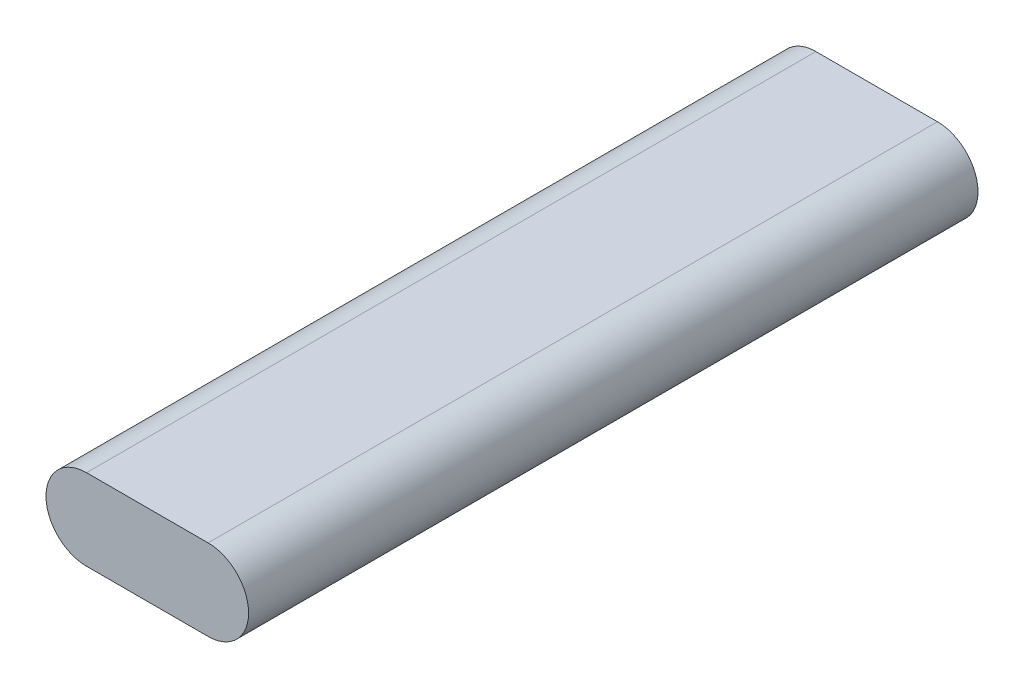
ISO-10303-21;
HEADER;
FILE_DESCRIPTION(('STEP AP214'),'2;1');
FILE_NAME('part.step','',(''),(''),'','','');
FILE_SCHEMA(('AUTOMOTIVE_DESIGN { 1 0 10303 214 1 1 1 1 }'));
ENDSEC;
DATA;
#1=APPLICATION_CONTEXT('core data for automotive mechanical design processes');
#2=APPLICATION_PROTOCOL_DEFINITION('international standard','automotive_design',2000,#1);
#3=PRODUCT_CONTEXT('',#1,'mechanical');
#4=PRODUCT('Part','Part','',(#3));
#5=PRODUCT_RELATED_PRODUCT_CATEGORY('part','',(#4));
#6=PRODUCT_DEFINITION_FORMATION('','',#4);
#7=PRODUCT_DEFINITION_CONTEXT('part definition',#1,'design');
#8=PRODUCT_DEFINITION('design','',#6,#7);
#9=PRODUCT_DEFINITION_SHAPE('','',#8);
#10=(LENGTH_UNIT() NAMED_UNIT(*) SI_UNIT(.MILLI.,.METRE.));
#11=(NAMED_UNIT(*) PLANE_ANGLE_UNIT() SI_UNIT($,.RADIAN.));
#12=(NAMED_UNIT(*) SI_UNIT($,.STERADIAN.) SOLID_ANGLE_UNIT());
#13=UNCERTAINTY_MEASURE_WITH_UNIT(LENGTH_MEASURE(1.E-05),#10,'distance_accuracy_value','');
#14=(GEOMETRIC_REPRESENTATION_CONTEXT(3) GLOBAL_UNCERTAINTY_ASSIGNED_CONTEXT((#13)) GLOBAL_UNIT_ASSIGNED_CONTEXT((#10,
#11,#12)) REPRESENTATION_CONTEXT('',''));
#15=CARTESIAN_POINT('',(0.,0.,0.));
#16=DIRECTION('',(0.,0.,1.));
#17=DIRECTION('',(1.,0.,0.));
#18=AXIS2_PLACEMENT_3D('',#15,#16,#17);
#19=CARTESIAN_POINT('',(-7.5,0.,45.));
#20=DIRECTION('',(0.,0.,-1.));
#21=DIRECTION('',(-1.,0.,0.));
#22=AXIS2_PLACEMENT_3D('',#19,#20,#21);
#23=CYLINDRICAL_SURFACE('',#22,5.);
#24=CARTESIAN_POINT('',(-7.5,0.,-45.));
#25=DIRECTION('',(0.,0.,1.));
#26=DIRECTION('',(1.,0.,0.));
#27=AXIS2_PLACEMENT_3D('',#24,#25,#26);
#28=CIRCLE('',#27,5.);
#29=CARTESIAN_POINT('',(-7.5,5.,-45.));
#30=VERTEX_POINT('',#29);
#31=CARTESIAN_POINT('',(-7.5,-5.,-45.));
#32=VERTEX_POINT('',#31);
#33=EDGE_CURVE('E96',#30,#32,#28,.T.);
#34=ORIENTED_EDGE('',*,*,#33,.T.);
#35=DIRECTION('',(0.,0.,-1.));
#36=VECTOR('',#35,1.);
#37=CARTESIAN_POINT('',(-7.5,-5.,45.));
#38=LINE('',#37,#36);
#39=CARTESIAN_POINT('',(-7.5,-5.,45.));
#40=VERTEX_POINT('',#39);
#41=EDGE_CURVE('E11',#40,#32,#38,.T.);
#42=ORIENTED_EDGE('',*,*,#41,.F.);
#43=CARTESIAN_POINT('',(-7.5,0.,45.));
#44=DIRECTION('',(0.,0.,1.));
#45=DIRECTION('',(1.,0.,0.));
#46=AXIS2_PLACEMENT_3D('',#43,#44,#45);
#47=CIRCLE('',#46,5.);
#48=CARTESIAN_POINT('',(-7.5,5.,45.));
#49=VERTEX_POINT('',#48);
#50=EDGE_CURVE('E84',#49,#40,#47,.T.);
#51=ORIENTED_EDGE('',*,*,#50,.F.);
#52=DIRECTION('',(0.,0.,-1.));
#53=VECTOR('',#52,1.);
#54=CARTESIAN_POINT('',(-7.5,5.,45.));
#55=LINE('',#54,#53);
#56=EDGE_CURVE('E92',#49,#30,#55,.T.);
#57=ORIENTED_EDGE('',*,*,#56,.T.);
#58=EDGE_LOOP('',(#34,#42,#51,#57));
#59=FACE_BOUND('',#58,.T.);
#60=ADVANCED_FACE('F33',(#59),#23,.T.);
#61=CARTESIAN_POINT('',(-7.5,-5.,45.));
#62=DIRECTION('',(0.,1.,0.));
#63=DIRECTION('',(-1.,0.,0.));
#64=AXIS2_PLACEMENT_3D('',#61,#62,#63);
#65=PLANE('',#64);
#66=DIRECTION('',(1.,0.,0.));
#67=VECTOR('',#66,1.);
#68=CARTESIAN_POINT('',(-7.5,-5.,-45.));
#69=LINE('',#68,#67);
#70=CARTESIAN_POINT('',(7.5,-5.,-45.));
#71=VERTEX_POINT('',#70);
#72=EDGE_CURVE('E88',#32,#71,#69,.T.);
#73=ORIENTED_EDGE('',*,*,#72,.T.);
#74=DIRECTION('',(0.,0.,-1.));
#75=VECTOR('',#74,1.);
#76=CARTESIAN_POINT('',(7.5,-5.,45.));
#77=LINE('',#76,#75);
#78=CARTESIAN_POINT('',(7.5,-5.,45.));
#79=VERTEX_POINT('',#78);
#80=EDGE_CURVE('E41',#79,#71,#77,.T.);
#81=ORIENTED_EDGE('',*,*,#80,.F.);
#82=DIRECTION('',(1.,0.,0.));
#83=VECTOR('',#82,1.);
#84=CARTESIAN_POINT('',(-7.5,-5.,45.));
#85=LINE('',#84,#83);
#86=EDGE_CURVE('E79',#40,#79,#85,.T.);
#87=ORIENTED_EDGE('',*,*,#86,.F.);
#88=ORIENTED_EDGE('',*,*,#41,.T.);
#89=EDGE_LOOP('',(#73,#81,#87,#88));
#90=FACE_BOUND('',#89,.T.);
#91=ADVANCED_FACE('F87',(#90),#65,.F.);
#92=CARTESIAN_POINT('',(7.5,0.,45.));
#93=DIRECTION('',(0.,0.,-1.));
#94=DIRECTION('',(-1.,0.,0.));
#95=AXIS2_PLACEMENT_3D('',#92,#93,#94);
#96=CYLINDRICAL_SURFACE('',#95,5.);
#97=CARTESIAN_POINT('',(7.5,0.,-45.));
#98=DIRECTION('',(0.,0.,1.));
#99=DIRECTION('',(1.,0.,0.));
#100=AXIS2_PLACEMENT_3D('',#97,#98,#99);
#101=CIRCLE('',#100,5.);
#102=CARTESIAN_POINT('',(7.5,5.,-45.));
#103=VERTEX_POINT('',#102);
#104=EDGE_CURVE('E66',#71,#103,#101,.T.);
#105=ORIENTED_EDGE('',*,*,#104,.T.);
#106=DIRECTION('',(0.,0.,-1.));
#107=VECTOR('',#106,1.);
#108=CARTESIAN_POINT('',(7.5,5.,45.));
#109=LINE('',#108,#107);
#110=CARTESIAN_POINT('',(7.5,5.,45.));
#111=VERTEX_POINT('',#110);
#112=EDGE_CURVE('E89',#111,#103,#109,.T.);
#113=ORIENTED_EDGE('',*,*,#112,.F.);
#114=CARTESIAN_POINT('',(7.5,0.,45.));
#115=DIRECTION('',(0.,0.,1.));
#116=DIRECTION('',(1.,0.,0.));
#117=AXIS2_PLACEMENT_3D('',#114,#115,#116);
#118=CIRCLE('',#117,5.);
#119=EDGE_CURVE('E82',#79,#111,#118,.T.);
#120=ORIENTED_EDGE('',*,*,#119,.F.);
#121=ORIENTED_EDGE('',*,*,#80,.T.);
#122=EDGE_LOOP('',(#105,#113,#120,#121));
#123=FACE_BOUND('',#122,.T.);
#124=ADVANCED_FACE('F90',(#123),#96,.T.);
#125=CARTESIAN_POINT('',(-7.5,5.,45.));
#126=DIRECTION('',(0.,-1.,0.));
#127=DIRECTION('',(1.,0.,0.));
#128=AXIS2_PLACEMENT_3D('',#125,#126,#127);
#129=PLANE('',#128);
#130=DIRECTION('',(-1.,0.,0.));
#131=VECTOR('',#130,1.);
#132=CARTESIAN_POINT('',(-7.5,5.,-45.));
#133=LINE('',#132,#131);
#134=EDGE_CURVE('E72',#103,#30,#133,.T.);
#135=ORIENTED_EDGE('',*,*,#134,.T.);
#136=ORIENTED_EDGE('',*,*,#56,.F.);
#137=DIRECTION('',(-1.,0.,0.));
#138=VECTOR('',#137,1.);
#139=CARTESIAN_POINT('',(-7.5,5.,45.));
#140=LINE('',#139,#138);
#141=EDGE_CURVE('E49',#111,#49,#140,.T.);
#142=ORIENTED_EDGE('',*,*,#141,.F.);
#143=ORIENTED_EDGE('',*,*,#112,.T.);
#144=EDGE_LOOP('',(#135,#136,#142,#143));
#145=FACE_BOUND('',#144,.T.);
#146=ADVANCED_FACE('F103',(#145),#129,.F.);
#147=CARTESIAN_POINT('',(-7.5,0.,45.));
#148=DIRECTION('',(0.,0.,1.));
#149=DIRECTION('',(1.,0.,0.));
#150=AXIS2_PLACEMENT_3D('',#147,#148,#149);
#151=PLANE('',#150);
#152=ORIENTED_EDGE('',*,*,#50,.T.);
#153=ORIENTED_EDGE('',*,*,#86,.T.);
#154=ORIENTED_EDGE('',*,*,#119,.T.);
#155=ORIENTED_EDGE('',*,*,#141,.T.);
#156=EDGE_LOOP('',(#152,#153,#154,#155));
#157=FACE_BOUND('',#156,.T.);
#158=ADVANCED_FACE('F80',(#157),#151,.T.);
#159=CARTESIAN_POINT('',(-7.5,0.,-45.));
#160=DIRECTION('',(0.,0.,1.));
#161=DIRECTION('',(1.,0.,0.));
#162=AXIS2_PLACEMENT_3D('',#159,#160,#161);
#163=PLANE('',#162);
#164=ORIENTED_EDGE('',*,*,#33,.F.);
#165=ORIENTED_EDGE('',*,*,#134,.F.);
#166=ORIENTED_EDGE('',*,*,#104,.F.);
#167=ORIENTED_EDGE('',*,*,#72,.F.);
#168=EDGE_LOOP('',(#164,#165,#166,#167));
#169=FACE_BOUND('',#168,.T.);
#170=ADVANCED_FACE('F106',(#169),#163,.F.);
#171=CLOSED_SHELL('',(#60,#91,#124,#146,#158,#170));
#172=MANIFOLD_SOLID_BREP('B2',#171);
#173=ADVANCED_BREP_SHAPE_REPRESENTATION('',(#18,#172),#14);
#174=SHAPE_DEFINITION_REPRESENTATION(#9,#173);
ENDSEC;
END-ISO-10303-21;
